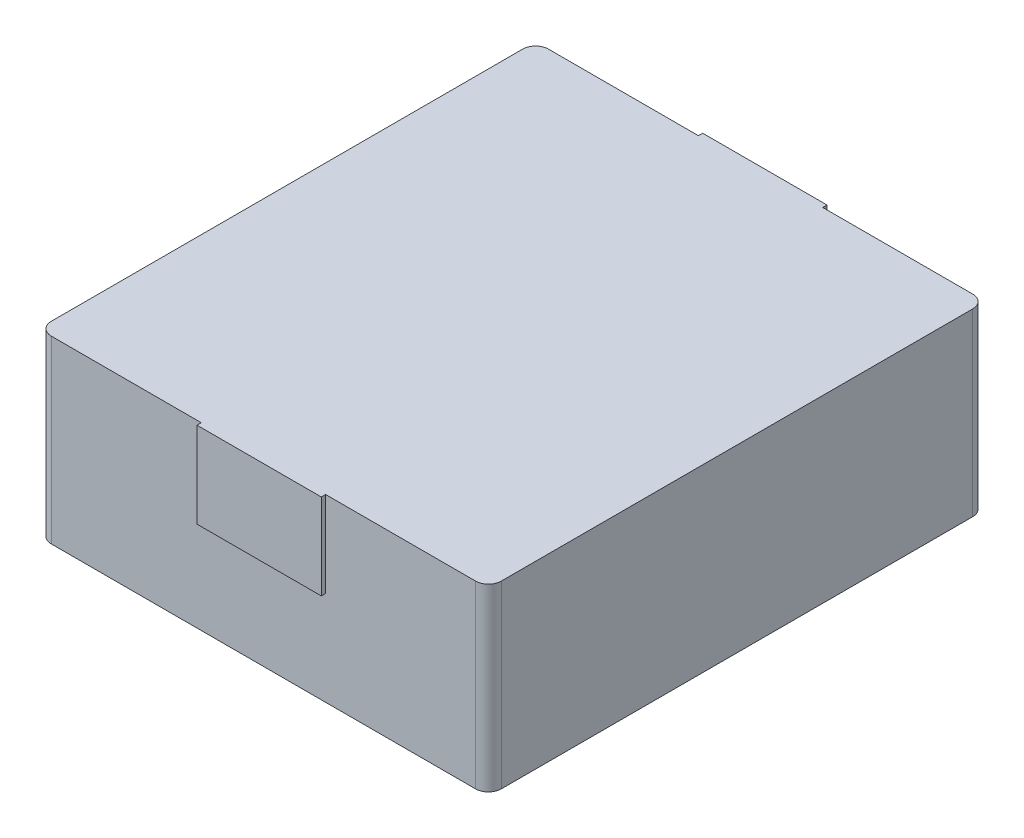
ISO-10303-21;
HEADER;
FILE_DESCRIPTION(('STEP AP214'),'2;1');
FILE_NAME('part.step','',(''),(''),'','','');
FILE_SCHEMA(('AUTOMOTIVE_DESIGN { 1 0 10303 214 1 1 1 1 }'));
ENDSEC;
DATA;
#1=APPLICATION_CONTEXT('core data for automotive mechanical design processes');
#2=APPLICATION_PROTOCOL_DEFINITION('international standard','automotive_design',2000,#1);
#3=PRODUCT_CONTEXT('',#1,'mechanical');
#4=PRODUCT('Part','Part','',(#3));
#5=PRODUCT_RELATED_PRODUCT_CATEGORY('part','',(#4));
#6=PRODUCT_DEFINITION_FORMATION('','',#4);
#7=PRODUCT_DEFINITION_CONTEXT('part definition',#1,'design');
#8=PRODUCT_DEFINITION('design','',#6,#7);
#9=PRODUCT_DEFINITION_SHAPE('','',#8);
#10=(LENGTH_UNIT() NAMED_UNIT(*) SI_UNIT(.MILLI.,.METRE.));
#11=(NAMED_UNIT(*) PLANE_ANGLE_UNIT() SI_UNIT($,.RADIAN.));
#12=(NAMED_UNIT(*) SI_UNIT($,.STERADIAN.) SOLID_ANGLE_UNIT());
#13=UNCERTAINTY_MEASURE_WITH_UNIT(LENGTH_MEASURE(1.E-05),#10,'distance_accuracy_value','');
#14=(GEOMETRIC_REPRESENTATION_CONTEXT(3) GLOBAL_UNCERTAINTY_ASSIGNED_CONTEXT((#13)) GLOBAL_UNIT_ASSIGNED_CONTEXT((#10,
#11,#12)) REPRESENTATION_CONTEXT('',''));
#15=CARTESIAN_POINT('',(0.,0.,0.));
#16=DIRECTION('',(0.,0.,1.));
#17=DIRECTION('',(1.,0.,0.));
#18=AXIS2_PLACEMENT_3D('',#15,#16,#17);
#19=CARTESIAN_POINT('',(32.2,5.8,-19.55));
#20=DIRECTION('',(0.,1.,0.));
#21=DIRECTION('',(0.,0.,1.));
#22=AXIS2_PLACEMENT_3D('',#19,#20,#21);
#23=PLANE('',#22);
#24=DIRECTION('',(0.,0.,1.));
#25=VECTOR('',#24,1.);
#26=CARTESIAN_POINT('',(35.1,5.8,-19.5));
#27=LINE('',#26,#25);
#28=CARTESIAN_POINT('',(35.1,5.8,-19.55));
#29=VERTEX_POINT('',#28);
#30=CARTESIAN_POINT('',(35.1,5.8,-19.45));
#31=VERTEX_POINT('',#30);
#32=EDGE_CURVE('E200',#29,#31,#27,.T.);
#33=ORIENTED_EDGE('',*,*,#32,.T.);
#34=DIRECTION('',(1.,0.,0.));
#35=VECTOR('',#34,1.);
#36=CARTESIAN_POINT('',(33.65,5.8,-19.45));
#37=LINE('',#36,#35);
#38=CARTESIAN_POINT('',(32.2,5.8,-19.45));
#39=VERTEX_POINT('',#38);
#40=EDGE_CURVE('E152',#39,#31,#37,.T.);
#41=ORIENTED_EDGE('',*,*,#40,.F.);
#42=DIRECTION('',(0.,0.,-1.));
#43=VECTOR('',#42,1.);
#44=CARTESIAN_POINT('',(32.2,5.8,-19.5));
#45=LINE('',#44,#43);
#46=CARTESIAN_POINT('',(32.2,5.8,-19.55));
#47=VERTEX_POINT('',#46);
#48=EDGE_CURVE('E199',#39,#47,#45,.T.);
#49=ORIENTED_EDGE('',*,*,#48,.T.);
#50=DIRECTION('',(1.,0.,0.));
#51=VECTOR('',#50,1.);
#52=CARTESIAN_POINT('',(33.65,5.8,-19.55));
#53=LINE('',#52,#51);
#54=EDGE_CURVE('E240',#47,#29,#53,.T.);
#55=ORIENTED_EDGE('',*,*,#54,.T.);
#56=EDGE_LOOP('',(#33,#41,#49,#55));
#57=FACE_BOUND('',#56,.T.);
#58=ADVANCED_FACE('F17',(#57),#23,.F.);
#59=CARTESIAN_POINT('',(35.1,7.8,-19.45));
#60=DIRECTION('',(-1.,0.,0.));
#61=DIRECTION('',(0.,0.,-1.));
#62=AXIS2_PLACEMENT_3D('',#59,#60,#61);
#63=PLANE('',#62);
#64=ORIENTED_EDGE('',*,*,#32,.F.);
#65=DIRECTION('',(0.,1.,0.));
#66=VECTOR('',#65,1.);
#67=CARTESIAN_POINT('',(35.1,6.8,-19.55));
#68=LINE('',#67,#66);
#69=CARTESIAN_POINT('',(35.1,7.8,-19.55));
#70=VERTEX_POINT('',#69);
#71=EDGE_CURVE('E209',#29,#70,#68,.T.);
#72=ORIENTED_EDGE('',*,*,#71,.T.);
#73=DIRECTION('',(0.,0.,-1.));
#74=VECTOR('',#73,1.);
#75=CARTESIAN_POINT('',(35.1,7.8,-19.5));
#76=LINE('',#75,#74);
#77=CARTESIAN_POINT('',(35.1,7.8,-19.45));
#78=VERTEX_POINT('',#77);
#79=EDGE_CURVE('E71',#78,#70,#76,.T.);
#80=ORIENTED_EDGE('',*,*,#79,.F.);
#81=DIRECTION('',(0.,1.,0.));
#82=VECTOR('',#81,1.);
#83=CARTESIAN_POINT('',(35.1,5.7,-19.45));
#84=LINE('',#83,#82);
#85=EDGE_CURVE('E150',#31,#78,#84,.T.);
#86=ORIENTED_EDGE('',*,*,#85,.F.);
#87=EDGE_LOOP('',(#64,#72,#80,#86));
#88=FACE_BOUND('',#87,.T.);
#89=ADVANCED_FACE('F327',(#88),#63,.F.);
#90=CARTESIAN_POINT('',(32.2,7.8,-19.55));
#91=DIRECTION('',(1.,0.,0.));
#92=DIRECTION('',(0.,0.,1.));
#93=AXIS2_PLACEMENT_3D('',#90,#91,#92);
#94=PLANE('',#93);
#95=ORIENTED_EDGE('',*,*,#48,.F.);
#96=DIRECTION('',(0.,-1.,0.));
#97=VECTOR('',#96,1.);
#98=CARTESIAN_POINT('',(32.2,5.7,-19.45));
#99=LINE('',#98,#97);
#100=CARTESIAN_POINT('',(32.2,7.8,-19.45));
#101=VERTEX_POINT('',#100);
#102=EDGE_CURVE('E146',#101,#39,#99,.T.);
#103=ORIENTED_EDGE('',*,*,#102,.F.);
#104=DIRECTION('',(0.,0.,1.));
#105=VECTOR('',#104,1.);
#106=CARTESIAN_POINT('',(32.2,7.8,-19.5));
#107=LINE('',#106,#105);
#108=CARTESIAN_POINT('',(32.2,7.8,-19.55));
#109=VERTEX_POINT('',#108);
#110=EDGE_CURVE('E196',#109,#101,#107,.T.);
#111=ORIENTED_EDGE('',*,*,#110,.F.);
#112=DIRECTION('',(0.,-1.,0.));
#113=VECTOR('',#112,1.);
#114=CARTESIAN_POINT('',(32.2,6.8,-19.55));
#115=LINE('',#114,#113);
#116=EDGE_CURVE('E243',#109,#47,#115,.T.);
#117=ORIENTED_EDGE('',*,*,#116,.T.);
#118=EDGE_LOOP('',(#95,#103,#111,#117));
#119=FACE_BOUND('',#118,.T.);
#120=ADVANCED_FACE('F317',(#119),#94,.F.);
#121=CARTESIAN_POINT('',(38.6,3.6,-19.15));
#122=DIRECTION('',(0.,1.,0.));
#123=DIRECTION('',(0.,0.,1.));
#124=AXIS2_PLACEMENT_3D('',#121,#122,#123);
#125=CYLINDRICAL_SURFACE('',#124,0.299999999999995);
#126=CARTESIAN_POINT('',(38.6,3.6,-19.15));
#127=DIRECTION('',(0.,1.,0.));
#128=DIRECTION('',(0.,0.,1.));
#129=AXIS2_PLACEMENT_3D('',#126,#127,#128);
#130=CIRCLE('',#129,0.299999999999995);
#131=CARTESIAN_POINT('',(38.6,3.6,-19.45));
#132=VERTEX_POINT('',#131);
#133=CARTESIAN_POINT('',(38.9,3.6,-19.15));
#134=VERTEX_POINT('',#133);
#135=EDGE_CURVE('E248',#132,#134,#130,.F.);
#136=ORIENTED_EDGE('',*,*,#135,.F.);
#137=DIRECTION('',(0.,-1.,0.));
#138=VECTOR('',#137,1.);
#139=CARTESIAN_POINT('',(38.6,5.7,-19.45));
#140=LINE('',#139,#138);
#141=CARTESIAN_POINT('',(38.6,7.8,-19.45));
#142=VERTEX_POINT('',#141);
#143=EDGE_CURVE('E147',#142,#132,#140,.T.);
#144=ORIENTED_EDGE('',*,*,#143,.F.);
#145=CARTESIAN_POINT('',(38.6,7.8,-19.15));
#146=DIRECTION('',(0.,1.,0.));
#147=DIRECTION('',(0.,0.,1.));
#148=AXIS2_PLACEMENT_3D('',#145,#146,#147);
#149=CIRCLE('',#148,0.299999999999995);
#150=CARTESIAN_POINT('',(38.9,7.8,-19.15));
#151=VERTEX_POINT('',#150);
#152=EDGE_CURVE('E21',#151,#142,#149,.T.);
#153=ORIENTED_EDGE('',*,*,#152,.F.);
#154=DIRECTION('',(0.,1.,0.));
#155=VECTOR('',#154,1.);
#156=CARTESIAN_POINT('',(38.9,5.7,-19.15));
#157=LINE('',#156,#155);
#158=EDGE_CURVE('E141',#134,#151,#157,.T.);
#159=ORIENTED_EDGE('',*,*,#158,.F.);
#160=EDGE_LOOP('',(#136,#144,#153,#159));
#161=FACE_BOUND('',#160,.T.);
#162=ADVANCED_FACE('F314',(#161),#125,.T.);
#163=CARTESIAN_POINT('',(32.2,5.8,-7.75));
#164=DIRECTION('',(0.,-1.,0.));
#165=DIRECTION('',(0.,0.,-1.));
#166=AXIS2_PLACEMENT_3D('',#163,#164,#165);
#167=PLANE('',#166);
#168=DIRECTION('',(1.,0.,0.));
#169=VECTOR('',#168,1.);
#170=CARTESIAN_POINT('',(33.65,5.8,-7.75));
#171=LINE('',#170,#169);
#172=CARTESIAN_POINT('',(32.2,5.8,-7.75));
#173=VERTEX_POINT('',#172);
#174=CARTESIAN_POINT('',(35.1,5.8,-7.75));
#175=VERTEX_POINT('',#174);
#176=EDGE_CURVE('E221',#173,#175,#171,.T.);
#177=ORIENTED_EDGE('',*,*,#176,.F.);
#178=DIRECTION('',(0.,0.,1.));
#179=VECTOR('',#178,1.);
#180=CARTESIAN_POINT('',(32.2,5.8,-7.8));
#181=LINE('',#180,#179);
#182=CARTESIAN_POINT('',(32.2,5.8,-7.85));
#183=VERTEX_POINT('',#182);
#184=EDGE_CURVE('E188',#183,#173,#181,.T.);
#185=ORIENTED_EDGE('',*,*,#184,.F.);
#186=DIRECTION('',(-1.,0.,0.));
#187=VECTOR('',#186,1.);
#188=CARTESIAN_POINT('',(33.65,5.8,-7.85));
#189=LINE('',#188,#187);
#190=CARTESIAN_POINT('',(35.1,5.8,-7.85));
#191=VERTEX_POINT('',#190);
#192=EDGE_CURVE('E178',#191,#183,#189,.T.);
#193=ORIENTED_EDGE('',*,*,#192,.F.);
#194=DIRECTION('',(0.,0.,-1.));
#195=VECTOR('',#194,1.);
#196=CARTESIAN_POINT('',(35.1,5.8,-7.8));
#197=LINE('',#196,#195);
#198=EDGE_CURVE('E170',#175,#191,#197,.T.);
#199=ORIENTED_EDGE('',*,*,#198,.F.);
#200=EDGE_LOOP('',(#177,#185,#193,#199));
#201=FACE_BOUND('',#200,.T.);
#202=ADVANCED_FACE('F316',(#201),#167,.T.);
#203=CARTESIAN_POINT('',(32.2,7.8,-7.75));
#204=DIRECTION('',(-1.,0.,0.));
#205=DIRECTION('',(0.,0.,-1.));
#206=AXIS2_PLACEMENT_3D('',#203,#204,#205);
#207=PLANE('',#206);
#208=DIRECTION('',(0.,-1.,0.));
#209=VECTOR('',#208,1.);
#210=CARTESIAN_POINT('',(32.2,6.8,-7.75));
#211=LINE('',#210,#209);
#212=CARTESIAN_POINT('',(32.2,7.8,-7.75));
#213=VERTEX_POINT('',#212);
#214=EDGE_CURVE('E143',#213,#173,#211,.T.);
#215=ORIENTED_EDGE('',*,*,#214,.F.);
#216=DIRECTION('',(0.,0.,-1.));
#217=VECTOR('',#216,1.);
#218=CARTESIAN_POINT('',(32.2,7.8,-7.8));
#219=LINE('',#218,#217);
#220=CARTESIAN_POINT('',(32.2,7.8,-7.85));
#221=VERTEX_POINT('',#220);
#222=EDGE_CURVE('E185',#213,#221,#219,.T.);
#223=ORIENTED_EDGE('',*,*,#222,.T.);
#224=DIRECTION('',(0.,1.,0.));
#225=VECTOR('',#224,1.);
#226=CARTESIAN_POINT('',(32.2,5.7,-7.85));
#227=LINE('',#226,#225);
#228=EDGE_CURVE('E181',#183,#221,#227,.T.);
#229=ORIENTED_EDGE('',*,*,#228,.F.);
#230=ORIENTED_EDGE('',*,*,#184,.T.);
#231=EDGE_LOOP('',(#215,#223,#229,#230));
#232=FACE_BOUND('',#231,.T.);
#233=ADVANCED_FACE('F324',(#232),#207,.T.);
#234=CARTESIAN_POINT('',(38.6,3.6,-8.15));
#235=DIRECTION('',(0.,1.,0.));
#236=DIRECTION('',(0.,0.,1.));
#237=AXIS2_PLACEMENT_3D('',#234,#235,#236);
#238=CYLINDRICAL_SURFACE('',#237,0.300000000000002);
#239=CARTESIAN_POINT('',(38.6,3.6,-8.15));
#240=DIRECTION('',(0.,1.,0.));
#241=DIRECTION('',(0.,0.,1.));
#242=AXIS2_PLACEMENT_3D('',#239,#240,#241);
#243=CIRCLE('',#242,0.300000000000002);
#244=CARTESIAN_POINT('',(38.9,3.6,-8.15));
#245=VERTEX_POINT('',#244);
#246=CARTESIAN_POINT('',(38.6,3.6,-7.85));
#247=VERTEX_POINT('',#246);
#248=EDGE_CURVE('E106',#245,#247,#243,.F.);
#249=ORIENTED_EDGE('',*,*,#248,.F.);
#250=DIRECTION('',(0.,-1.,0.));
#251=VECTOR('',#250,1.);
#252=CARTESIAN_POINT('',(38.9,5.7,-8.15));
#253=LINE('',#252,#251);
#254=CARTESIAN_POINT('',(38.9,7.8,-8.15));
#255=VERTEX_POINT('',#254);
#256=EDGE_CURVE('E144',#255,#245,#253,.T.);
#257=ORIENTED_EDGE('',*,*,#256,.F.);
#258=CARTESIAN_POINT('',(38.6,7.8,-8.15));
#259=DIRECTION('',(0.,1.,0.));
#260=DIRECTION('',(0.,0.,1.));
#261=AXIS2_PLACEMENT_3D('',#258,#259,#260);
#262=CIRCLE('',#261,0.300000000000002);
#263=CARTESIAN_POINT('',(38.6,7.8,-7.85));
#264=VERTEX_POINT('',#263);
#265=EDGE_CURVE('E129',#264,#255,#262,.T.);
#266=ORIENTED_EDGE('',*,*,#265,.F.);
#267=DIRECTION('',(0.,1.,0.));
#268=VECTOR('',#267,1.);
#269=CARTESIAN_POINT('',(38.6,5.7,-7.85));
#270=LINE('',#269,#268);
#271=EDGE_CURVE('E121',#247,#264,#270,.T.);
#272=ORIENTED_EDGE('',*,*,#271,.F.);
#273=EDGE_LOOP('',(#249,#257,#266,#272));
#274=FACE_BOUND('',#273,.T.);
#275=ADVANCED_FACE('F128',(#274),#238,.T.);
#276=CARTESIAN_POINT('',(35.1,7.8,-7.85));
#277=DIRECTION('',(1.,0.,0.));
#278=DIRECTION('',(0.,0.,1.));
#279=AXIS2_PLACEMENT_3D('',#276,#277,#278);
#280=PLANE('',#279);
#281=DIRECTION('',(0.,1.,0.));
#282=VECTOR('',#281,1.);
#283=CARTESIAN_POINT('',(35.1,6.8,-7.75));
#284=LINE('',#283,#282);
#285=CARTESIAN_POINT('',(35.1,7.8,-7.75));
#286=VERTEX_POINT('',#285);
#287=EDGE_CURVE('E182',#175,#286,#284,.T.);
#288=ORIENTED_EDGE('',*,*,#287,.F.);
#289=ORIENTED_EDGE('',*,*,#198,.T.);
#290=DIRECTION('',(0.,-1.,0.));
#291=VECTOR('',#290,1.);
#292=CARTESIAN_POINT('',(35.1,5.7,-7.85));
#293=LINE('',#292,#291);
#294=CARTESIAN_POINT('',(35.1,7.8,-7.85));
#295=VERTEX_POINT('',#294);
#296=EDGE_CURVE('E130',#295,#191,#293,.T.);
#297=ORIENTED_EDGE('',*,*,#296,.F.);
#298=DIRECTION('',(0.,0.,1.));
#299=VECTOR('',#298,1.);
#300=CARTESIAN_POINT('',(35.1,7.8,-7.8));
#301=LINE('',#300,#299);
#302=EDGE_CURVE('E167',#295,#286,#301,.T.);
#303=ORIENTED_EDGE('',*,*,#302,.T.);
#304=EDGE_LOOP('',(#288,#289,#297,#303));
#305=FACE_BOUND('',#304,.T.);
#306=ADVANCED_FACE('F355',(#305),#280,.T.);
#307=CARTESIAN_POINT('',(28.7,3.6,-8.15));
#308=DIRECTION('',(0.,1.,0.));
#309=DIRECTION('',(0.,0.,1.));
#310=AXIS2_PLACEMENT_3D('',#307,#308,#309);
#311=CYLINDRICAL_SURFACE('',#310,0.299999999999998);
#312=CARTESIAN_POINT('',(28.7,3.6,-8.15));
#313=DIRECTION('',(0.,1.,0.));
#314=DIRECTION('',(0.,0.,1.));
#315=AXIS2_PLACEMENT_3D('',#312,#313,#314);
#316=CIRCLE('',#315,0.299999999999998);
#317=CARTESIAN_POINT('',(28.7,3.6,-7.85));
#318=VERTEX_POINT('',#317);
#319=CARTESIAN_POINT('',(28.4,3.6,-8.15));
#320=VERTEX_POINT('',#319);
#321=EDGE_CURVE('E115',#318,#320,#316,.F.);
#322=ORIENTED_EDGE('',*,*,#321,.F.);
#323=DIRECTION('',(0.,-1.,0.));
#324=VECTOR('',#323,1.);
#325=CARTESIAN_POINT('',(28.7,5.7,-7.85));
#326=LINE('',#325,#324);
#327=CARTESIAN_POINT('',(28.7,7.8,-7.85));
#328=VERTEX_POINT('',#327);
#329=EDGE_CURVE('E125',#328,#318,#326,.T.);
#330=ORIENTED_EDGE('',*,*,#329,.F.);
#331=CARTESIAN_POINT('',(28.7,7.8,-8.15));
#332=DIRECTION('',(0.,1.,0.));
#333=DIRECTION('',(0.,0.,1.));
#334=AXIS2_PLACEMENT_3D('',#331,#332,#333);
#335=CIRCLE('',#334,0.299999999999998);
#336=CARTESIAN_POINT('',(28.4,7.8,-8.15));
#337=VERTEX_POINT('',#336);
#338=EDGE_CURVE('E175',#337,#328,#335,.T.);
#339=ORIENTED_EDGE('',*,*,#338,.F.);
#340=DIRECTION('',(0.,1.,0.));
#341=VECTOR('',#340,1.);
#342=CARTESIAN_POINT('',(28.4,5.7,-8.15));
#343=LINE('',#342,#341);
#344=EDGE_CURVE('E133',#320,#337,#343,.T.);
#345=ORIENTED_EDGE('',*,*,#344,.F.);
#346=EDGE_LOOP('',(#322,#330,#339,#345));
#347=FACE_BOUND('',#346,.T.);
#348=ADVANCED_FACE('F302',(#347),#311,.T.);
#349=CARTESIAN_POINT('',(28.7,3.6,-19.15));
#350=DIRECTION('',(0.,1.,0.));
#351=DIRECTION('',(0.,0.,1.));
#352=AXIS2_PLACEMENT_3D('',#349,#350,#351);
#353=CYLINDRICAL_SURFACE('',#352,0.299999999999998);
#354=CARTESIAN_POINT('',(28.7,3.6,-19.15));
#355=DIRECTION('',(0.,1.,0.));
#356=DIRECTION('',(0.,0.,1.));
#357=AXIS2_PLACEMENT_3D('',#354,#355,#356);
#358=CIRCLE('',#357,0.299999999999998);
#359=CARTESIAN_POINT('',(28.4,3.6,-19.15));
#360=VERTEX_POINT('',#359);
#361=CARTESIAN_POINT('',(28.7,3.6,-19.45));
#362=VERTEX_POINT('',#361);
#363=EDGE_CURVE('E261',#360,#362,#358,.F.);
#364=ORIENTED_EDGE('',*,*,#363,.F.);
#365=DIRECTION('',(0.,-1.,0.));
#366=VECTOR('',#365,1.);
#367=CARTESIAN_POINT('',(28.4,5.7,-19.15));
#368=LINE('',#367,#366);
#369=CARTESIAN_POINT('',(28.4,7.8,-19.15));
#370=VERTEX_POINT('',#369);
#371=EDGE_CURVE('E166',#370,#360,#368,.T.);
#372=ORIENTED_EDGE('',*,*,#371,.F.);
#373=CARTESIAN_POINT('',(28.7,7.8,-19.15));
#374=DIRECTION('',(0.,1.,0.));
#375=DIRECTION('',(0.,0.,1.));
#376=AXIS2_PLACEMENT_3D('',#373,#374,#375);
#377=CIRCLE('',#376,0.299999999999998);
#378=CARTESIAN_POINT('',(28.7,7.8,-19.45));
#379=VERTEX_POINT('',#378);
#380=EDGE_CURVE('E36',#379,#370,#377,.T.);
#381=ORIENTED_EDGE('',*,*,#380,.F.);
#382=DIRECTION('',(0.,1.,0.));
#383=VECTOR('',#382,1.);
#384=CARTESIAN_POINT('',(28.7,5.7,-19.45));
#385=LINE('',#384,#383);
#386=EDGE_CURVE('E155',#362,#379,#385,.T.);
#387=ORIENTED_EDGE('',*,*,#386,.F.);
#388=EDGE_LOOP('',(#364,#372,#381,#387));
#389=FACE_BOUND('',#388,.T.);
#390=ADVANCED_FACE('F309',(#389),#353,.T.);
#391=CARTESIAN_POINT('',(28.29395,3.6,-7.734));
#392=DIRECTION('',(0.,-1.,0.));
#393=DIRECTION('',(0.,0.,-1.));
#394=AXIS2_PLACEMENT_3D('',#391,#392,#393);
#395=PLANE('',#394);
#396=ORIENTED_EDGE('',*,*,#135,.T.);
#397=DIRECTION('',(0.,0.,-1.));
#398=VECTOR('',#397,1.);
#399=CARTESIAN_POINT('',(38.9,3.6,-13.65));
#400=LINE('',#399,#398);
#401=EDGE_CURVE('E111',#245,#134,#400,.T.);
#402=ORIENTED_EDGE('',*,*,#401,.F.);
#403=ORIENTED_EDGE('',*,*,#248,.T.);
#404=DIRECTION('',(1.,0.,0.));
#405=VECTOR('',#404,1.);
#406=CARTESIAN_POINT('',(33.65,3.6,-7.85));
#407=LINE('',#406,#405);
#408=EDGE_CURVE('E109',#318,#247,#407,.T.);
#409=ORIENTED_EDGE('',*,*,#408,.F.);
#410=ORIENTED_EDGE('',*,*,#321,.T.);
#411=DIRECTION('',(0.,0.,1.));
#412=VECTOR('',#411,1.);
#413=CARTESIAN_POINT('',(28.4,3.6,-13.65));
#414=LINE('',#413,#412);
#415=EDGE_CURVE('E162',#360,#320,#414,.T.);
#416=ORIENTED_EDGE('',*,*,#415,.F.);
#417=ORIENTED_EDGE('',*,*,#363,.T.);
#418=DIRECTION('',(-1.,0.,0.));
#419=VECTOR('',#418,1.);
#420=CARTESIAN_POINT('',(33.65,3.6,-19.45));
#421=LINE('',#420,#419);
#422=EDGE_CURVE('E149',#132,#362,#421,.T.);
#423=ORIENTED_EDGE('',*,*,#422,.F.);
#424=EDGE_LOOP('',(#396,#402,#403,#409,#410,#416,#417,#423));
#425=FACE_BOUND('',#424,.T.);
#426=ADVANCED_FACE('F108',(#425),#395,.T.);
#427=CARTESIAN_POINT('',(35.1,7.8,-19.55));
#428=DIRECTION('',(0.,0.,1.));
#429=DIRECTION('',(-1.,0.,0.));
#430=AXIS2_PLACEMENT_3D('',#427,#428,#429);
#431=PLANE('',#430);
#432=ORIENTED_EDGE('',*,*,#54,.F.);
#433=ORIENTED_EDGE('',*,*,#116,.F.);
#434=DIRECTION('',(1.,0.,0.));
#435=VECTOR('',#434,1.);
#436=CARTESIAN_POINT('',(33.649475,7.8,-19.55));
#437=LINE('',#436,#435);
#438=EDGE_CURVE('E251',#109,#70,#437,.T.);
#439=ORIENTED_EDGE('',*,*,#438,.T.);
#440=ORIENTED_EDGE('',*,*,#71,.F.);
#441=EDGE_LOOP('',(#432,#433,#439,#440));
#442=FACE_BOUND('',#441,.T.);
#443=ADVANCED_FACE('F349',(#442),#431,.F.);
#444=CARTESIAN_POINT('',(28.7,7.8,-19.45));
#445=DIRECTION('',(0.,0.,-1.));
#446=DIRECTION('',(1.,0.,0.));
#447=AXIS2_PLACEMENT_3D('',#444,#445,#446);
#448=PLANE('',#447);
#449=DIRECTION('',(1.,0.,0.));
#450=VECTOR('',#449,1.);
#451=CARTESIAN_POINT('',(33.649475,7.8,-19.45));
#452=LINE('',#451,#450);
#453=EDGE_CURVE('E165',#379,#101,#452,.T.);
#454=ORIENTED_EDGE('',*,*,#453,.T.);
#455=ORIENTED_EDGE('',*,*,#102,.T.);
#456=ORIENTED_EDGE('',*,*,#40,.T.);
#457=ORIENTED_EDGE('',*,*,#85,.T.);
#458=DIRECTION('',(1.,0.,0.));
#459=VECTOR('',#458,1.);
#460=CARTESIAN_POINT('',(33.649475,7.8,-19.45));
#461=LINE('',#460,#459);
#462=EDGE_CURVE('E254',#78,#142,#461,.T.);
#463=ORIENTED_EDGE('',*,*,#462,.T.);
#464=ORIENTED_EDGE('',*,*,#143,.T.);
#465=ORIENTED_EDGE('',*,*,#422,.T.);
#466=ORIENTED_EDGE('',*,*,#386,.T.);
#467=EDGE_LOOP('',(#454,#455,#456,#457,#463,#464,#465,#466));
#468=FACE_BOUND('',#467,.T.);
#469=ADVANCED_FACE('F312',(#468),#448,.T.);
#470=CARTESIAN_POINT('',(38.9,7.8,-19.15));
#471=DIRECTION('',(1.,0.,0.));
#472=DIRECTION('',(0.,0.,1.));
#473=AXIS2_PLACEMENT_3D('',#470,#471,#472);
#474=PLANE('',#473);
#475=ORIENTED_EDGE('',*,*,#158,.T.);
#476=DIRECTION('',(0.,0.,1.));
#477=VECTOR('',#476,1.);
#478=CARTESIAN_POINT('',(38.9,7.8,-13.65));
#479=LINE('',#478,#477);
#480=EDGE_CURVE('E266',#151,#255,#479,.T.);
#481=ORIENTED_EDGE('',*,*,#480,.T.);
#482=ORIENTED_EDGE('',*,*,#256,.T.);
#483=ORIENTED_EDGE('',*,*,#401,.T.);
#484=EDGE_LOOP('',(#475,#481,#482,#483));
#485=FACE_BOUND('',#484,.T.);
#486=ADVANCED_FACE('F269',(#485),#474,.T.);
#487=CARTESIAN_POINT('',(35.1,7.8,-7.75));
#488=DIRECTION('',(0.,0.,1.));
#489=DIRECTION('',(-1.,0.,0.));
#490=AXIS2_PLACEMENT_3D('',#487,#488,#489);
#491=PLANE('',#490);
#492=ORIENTED_EDGE('',*,*,#176,.T.);
#493=ORIENTED_EDGE('',*,*,#287,.T.);
#494=DIRECTION('',(-1.,0.,0.));
#495=VECTOR('',#494,1.);
#496=CARTESIAN_POINT('',(33.649475,7.8,-7.75));
#497=LINE('',#496,#495);
#498=EDGE_CURVE('E230',#286,#213,#497,.T.);
#499=ORIENTED_EDGE('',*,*,#498,.T.);
#500=ORIENTED_EDGE('',*,*,#214,.T.);
#501=EDGE_LOOP('',(#492,#493,#499,#500));
#502=FACE_BOUND('',#501,.T.);
#503=ADVANCED_FACE('F339',(#502),#491,.T.);
#504=CARTESIAN_POINT('',(38.6,7.8,-7.85));
#505=DIRECTION('',(0.,0.,1.));
#506=DIRECTION('',(-1.,0.,0.));
#507=AXIS2_PLACEMENT_3D('',#504,#505,#506);
#508=PLANE('',#507);
#509=DIRECTION('',(-1.,0.,0.));
#510=VECTOR('',#509,1.);
#511=CARTESIAN_POINT('',(33.649475,7.8,-7.85));
#512=LINE('',#511,#510);
#513=EDGE_CURVE('E233',#264,#295,#512,.T.);
#514=ORIENTED_EDGE('',*,*,#513,.T.);
#515=ORIENTED_EDGE('',*,*,#296,.T.);
#516=ORIENTED_EDGE('',*,*,#192,.T.);
#517=ORIENTED_EDGE('',*,*,#228,.T.);
#518=DIRECTION('',(-1.,0.,0.));
#519=VECTOR('',#518,1.);
#520=CARTESIAN_POINT('',(33.649475,7.8,-7.85));
#521=LINE('',#520,#519);
#522=EDGE_CURVE('E27',#221,#328,#521,.T.);
#523=ORIENTED_EDGE('',*,*,#522,.T.);
#524=ORIENTED_EDGE('',*,*,#329,.T.);
#525=ORIENTED_EDGE('',*,*,#408,.T.);
#526=ORIENTED_EDGE('',*,*,#271,.T.);
#527=EDGE_LOOP('',(#514,#515,#516,#517,#523,#524,#525,#526));
#528=FACE_BOUND('',#527,.T.);
#529=ADVANCED_FACE('F120',(#528),#508,.T.);
#530=CARTESIAN_POINT('',(28.4,7.8,-8.15));
#531=DIRECTION('',(-1.,0.,0.));
#532=DIRECTION('',(0.,0.,-1.));
#533=AXIS2_PLACEMENT_3D('',#530,#531,#532);
#534=PLANE('',#533);
#535=ORIENTED_EDGE('',*,*,#371,.T.);
#536=ORIENTED_EDGE('',*,*,#415,.T.);
#537=ORIENTED_EDGE('',*,*,#344,.T.);
#538=DIRECTION('',(0.,0.,-1.));
#539=VECTOR('',#538,1.);
#540=CARTESIAN_POINT('',(28.4,7.8,-13.65));
#541=LINE('',#540,#539);
#542=EDGE_CURVE('E11',#337,#370,#541,.T.);
#543=ORIENTED_EDGE('',*,*,#542,.T.);
#544=EDGE_LOOP('',(#535,#536,#537,#543));
#545=FACE_BOUND('',#544,.T.);
#546=ADVANCED_FACE('F305',(#545),#534,.T.);
#547=CARTESIAN_POINT('',(28.29395,7.8,-7.75));
#548=DIRECTION('',(0.,-1.,0.));
#549=DIRECTION('',(0.,0.,-1.));
#550=AXIS2_PLACEMENT_3D('',#547,#548,#549);
#551=PLANE('',#550);
#552=ORIENTED_EDGE('',*,*,#542,.F.);
#553=ORIENTED_EDGE('',*,*,#338,.T.);
#554=ORIENTED_EDGE('',*,*,#522,.F.);
#555=ORIENTED_EDGE('',*,*,#222,.F.);
#556=ORIENTED_EDGE('',*,*,#498,.F.);
#557=ORIENTED_EDGE('',*,*,#302,.F.);
#558=ORIENTED_EDGE('',*,*,#513,.F.);
#559=ORIENTED_EDGE('',*,*,#265,.T.);
#560=ORIENTED_EDGE('',*,*,#480,.F.);
#561=ORIENTED_EDGE('',*,*,#152,.T.);
#562=ORIENTED_EDGE('',*,*,#462,.F.);
#563=ORIENTED_EDGE('',*,*,#79,.T.);
#564=ORIENTED_EDGE('',*,*,#438,.F.);
#565=ORIENTED_EDGE('',*,*,#110,.T.);
#566=ORIENTED_EDGE('',*,*,#453,.F.);
#567=ORIENTED_EDGE('',*,*,#380,.T.);
#568=EDGE_LOOP('',(#552,#553,#554,#555,#556,#557,#558,#559,#560,#561,#562,#563,#564,#565,#566,#567));
#569=FACE_BOUND('',#568,.T.);
#570=ADVANCED_FACE('F19',(#569),#551,.F.);
#571=CLOSED_SHELL('',(#58,#89,#120,#162,#202,#233,#275,#306,#348,#390,#426,#443,#469,#486,#503,
#529,#546,#570));
#572=MANIFOLD_SOLID_BREP('B1',#571);
#573=ADVANCED_BREP_SHAPE_REPRESENTATION('',(#18,#572),#14);
#574=SHAPE_DEFINITION_REPRESENTATION(#9,#573);
ENDSEC;
END-ISO-10303-21;
